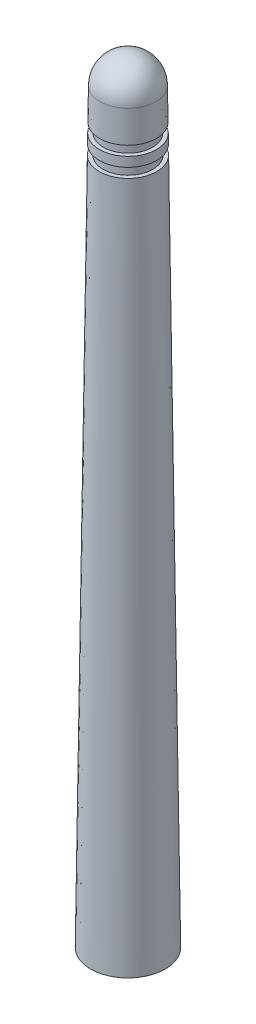
ISO-10303-21;
HEADER;
FILE_DESCRIPTION(('STEP AP214'),'2;1');
FILE_NAME('part.step','',(''),(''),'','','');
FILE_SCHEMA(('AUTOMOTIVE_DESIGN { 1 0 10303 214 1 1 1 1 }'));
ENDSEC;
DATA;
#1=APPLICATION_CONTEXT('core data for automotive mechanical design processes');
#2=APPLICATION_PROTOCOL_DEFINITION('international standard','automotive_design',2000,#1);
#3=PRODUCT_CONTEXT('',#1,'mechanical');
#4=PRODUCT('Part','Part','',(#3));
#5=PRODUCT_RELATED_PRODUCT_CATEGORY('part','',(#4));
#6=PRODUCT_DEFINITION_FORMATION('','',#4);
#7=PRODUCT_DEFINITION_CONTEXT('part definition',#1,'design');
#8=PRODUCT_DEFINITION('design','',#6,#7);
#9=PRODUCT_DEFINITION_SHAPE('','',#8);
#10=(LENGTH_UNIT() NAMED_UNIT(*) SI_UNIT(.MILLI.,.METRE.));
#11=(NAMED_UNIT(*) PLANE_ANGLE_UNIT() SI_UNIT($,.RADIAN.));
#12=(NAMED_UNIT(*) SI_UNIT($,.STERADIAN.) SOLID_ANGLE_UNIT());
#13=UNCERTAINTY_MEASURE_WITH_UNIT(LENGTH_MEASURE(1.E-05),#10,'distance_accuracy_value','');
#14=(GEOMETRIC_REPRESENTATION_CONTEXT(3) GLOBAL_UNCERTAINTY_ASSIGNED_CONTEXT((#13)) GLOBAL_UNIT_ASSIGNED_CONTEXT((#10,
#11,#12)) REPRESENTATION_CONTEXT('',''));
#15=CARTESIAN_POINT('',(0.,0.,0.));
#16=DIRECTION('',(0.,0.,1.));
#17=DIRECTION('',(1.,0.,0.));
#18=AXIS2_PLACEMENT_3D('',#15,#16,#17);
#19=CARTESIAN_POINT('',(0.,0.,0.));
#20=DIRECTION('',(0.,-1.,0.));
#21=DIRECTION('',(1.,0.,0.));
#22=AXIS2_PLACEMENT_3D('',#19,#20,#21);
#23=PLANE('',#22);
#24=CARTESIAN_POINT('',(0.,0.,0.));
#25=DIRECTION('',(0.,1.,0.));
#26=DIRECTION('',(-1.,0.,0.));
#27=AXIS2_PLACEMENT_3D('',#24,#25,#26);
#28=CIRCLE('',#27,5.);
#29=CARTESIAN_POINT('',(-5.,0.,0.));
#30=VERTEX_POINT('',#29);
#31=EDGE_CURVE('E10',#30,#30,#28,.T.);
#32=ORIENTED_EDGE('',*,*,#31,.F.);
#33=EDGE_LOOP('',(#32));
#34=FACE_BOUND('',#33,.T.);
#35=ADVANCED_FACE('F31',(#34),#23,.T.);
#36=CARTESIAN_POINT('',(0.,91.9383059519922,0.));
#37=DIRECTION('',(0.,-1.,0.));
#38=DIRECTION('',(1.,0.,0.));
#39=AXIS2_PLACEMENT_3D('',#36,#37,#38);
#40=CONICAL_SURFACE('',#39,3.85077117560009,0.0124993490193617);
#41=ORIENTED_EDGE('',*,*,#31,.T.);
#42=EDGE_LOOP('',(#41));
#43=FACE_BOUND('',#42,.T.);
#44=CARTESIAN_POINT('',(0.,91.9383059519922,0.));
#45=DIRECTION('',(0.,1.,0.));
#46=DIRECTION('',(-1.,0.,0.));
#47=AXIS2_PLACEMENT_3D('',#44,#45,#46);
#48=CIRCLE('',#47,3.85077117560009);
#49=CARTESIAN_POINT('',(-3.8507711756001,91.9383059519922,0.));
#50=VERTEX_POINT('',#49);
#51=EDGE_CURVE('E37',#50,#50,#48,.T.);
#52=ORIENTED_EDGE('',*,*,#51,.F.);
#53=EDGE_LOOP('',(#52));
#54=FACE_BOUND('',#53,.T.);
#55=ADVANCED_FACE('F85',(#43,#54),#40,.T.);
#56=CARTESIAN_POINT('',(-3.33488870350915,91.9383059519922,0.));
#57=DIRECTION('',(0.,1.,0.));
#58=DIRECTION('',(-1.,0.,0.));
#59=AXIS2_PLACEMENT_3D('',#56,#57,#58);
#60=PLANE('',#59);
#61=ORIENTED_EDGE('',*,*,#51,.T.);
#62=EDGE_LOOP('',(#61));
#63=FACE_BOUND('',#62,.T.);
#64=CARTESIAN_POINT('',(0.,91.9383059519922,0.));
#65=DIRECTION('',(0.,1.,0.));
#66=DIRECTION('',(-1.,0.,0.));
#67=AXIS2_PLACEMENT_3D('',#64,#65,#66);
#68=CIRCLE('',#67,3.33488870350915);
#69=CARTESIAN_POINT('',(-3.33488870350915,91.9383059519922,0.));
#70=VERTEX_POINT('',#69);
#71=EDGE_CURVE('E41',#70,#70,#68,.T.);
#72=ORIENTED_EDGE('',*,*,#71,.F.);
#73=EDGE_LOOP('',(#72));
#74=FACE_BOUND('',#73,.T.);
#75=ADVANCED_FACE('F90',(#63,#74),#60,.T.);
#76=CARTESIAN_POINT('',(0.,100.,0.));
#77=DIRECTION('',(0.,1.,0.));
#78=DIRECTION('',(-1.,0.,0.));
#79=AXIS2_PLACEMENT_3D('',#76,#77,#78);
#80=CYLINDRICAL_SURFACE('',#79,3.33488870350915);
#81=ORIENTED_EDGE('',*,*,#71,.T.);
#82=EDGE_LOOP('',(#81));
#83=FACE_BOUND('',#82,.T.);
#84=CARTESIAN_POINT('',(0.,93.208903719268,0.));
#85=DIRECTION('',(0.,1.,0.));
#86=DIRECTION('',(-1.,0.,0.));
#87=AXIS2_PLACEMENT_3D('',#84,#85,#86);
#88=CIRCLE('',#87,3.33488870350915);
#89=CARTESIAN_POINT('',(-3.33488870350915,93.208903719268,0.));
#90=VERTEX_POINT('',#89);
#91=EDGE_CURVE('E45',#90,#90,#88,.T.);
#92=ORIENTED_EDGE('',*,*,#91,.F.);
#93=EDGE_LOOP('',(#92));
#94=FACE_BOUND('',#93,.T.);
#95=ADVANCED_FACE('F94',(#83,#94),#80,.T.);
#96=CARTESIAN_POINT('',(-3.83488870350915,93.208903719268,0.));
#97=DIRECTION('',(0.,-1.,0.));
#98=DIRECTION('',(1.,0.,0.));
#99=AXIS2_PLACEMENT_3D('',#96,#97,#98);
#100=PLANE('',#99);
#101=ORIENTED_EDGE('',*,*,#91,.T.);
#102=EDGE_LOOP('',(#101));
#103=FACE_BOUND('',#102,.T.);
#104=CARTESIAN_POINT('',(0.,93.208903719268,0.));
#105=DIRECTION('',(0.,1.,0.));
#106=DIRECTION('',(-1.,0.,0.));
#107=AXIS2_PLACEMENT_3D('',#104,#105,#106);
#108=CIRCLE('',#107,3.83488870350915);
#109=CARTESIAN_POINT('',(-3.83488870350915,93.208903719268,0.));
#110=VERTEX_POINT('',#109);
#111=EDGE_CURVE('E50',#110,#110,#108,.T.);
#112=ORIENTED_EDGE('',*,*,#111,.F.);
#113=EDGE_LOOP('',(#112));
#114=FACE_BOUND('',#113,.T.);
#115=ADVANCED_FACE('F100',(#103,#114),#100,.T.);
#116=CARTESIAN_POINT('',(0.,94.4794022327243,0.));
#117=DIRECTION('',(0.,-1.,0.));
#118=DIRECTION('',(1.,0.,0.));
#119=AXIS2_PLACEMENT_3D('',#116,#117,#118);
#120=CONICAL_SURFACE('',#119,3.81900747209094,0.0124993490193615);
#121=ORIENTED_EDGE('',*,*,#111,.T.);
#122=EDGE_LOOP('',(#121));
#123=FACE_BOUND('',#122,.T.);
#124=CARTESIAN_POINT('',(0.,94.4794022327243,0.));
#125=DIRECTION('',(0.,1.,0.));
#126=DIRECTION('',(-1.,0.,0.));
#127=AXIS2_PLACEMENT_3D('',#124,#125,#126);
#128=CIRCLE('',#127,3.81900747209094);
#129=CARTESIAN_POINT('',(-3.81900747209095,94.4794022327243,0.));
#130=VERTEX_POINT('',#129);
#131=EDGE_CURVE('E53',#130,#130,#128,.T.);
#132=ORIENTED_EDGE('',*,*,#131,.F.);
#133=EDGE_LOOP('',(#132));
#134=FACE_BOUND('',#133,.T.);
#135=ADVANCED_FACE('F104',(#123,#134),#120,.T.);
#136=CARTESIAN_POINT('',(-3.303125,94.4794022327243,0.));
#137=DIRECTION('',(0.,1.,0.));
#138=DIRECTION('',(-1.,0.,0.));
#139=AXIS2_PLACEMENT_3D('',#136,#137,#138);
#140=PLANE('',#139);
#141=ORIENTED_EDGE('',*,*,#131,.T.);
#142=EDGE_LOOP('',(#141));
#143=FACE_BOUND('',#142,.T.);
#144=CARTESIAN_POINT('',(0.,94.4794022327243,0.));
#145=DIRECTION('',(0.,1.,0.));
#146=DIRECTION('',(-1.,0.,0.));
#147=AXIS2_PLACEMENT_3D('',#144,#145,#146);
#148=CIRCLE('',#147,3.303125);
#149=CARTESIAN_POINT('',(-3.303125,94.4794022327243,0.));
#150=VERTEX_POINT('',#149);
#151=EDGE_CURVE('E56',#150,#150,#148,.T.);
#152=ORIENTED_EDGE('',*,*,#151,.F.);
#153=EDGE_LOOP('',(#152));
#154=FACE_BOUND('',#153,.T.);
#155=ADVANCED_FACE('F108',(#143,#154),#140,.T.);
#156=CARTESIAN_POINT('',(0.,100.,0.));
#157=DIRECTION('',(0.,1.,0.));
#158=DIRECTION('',(-1.,0.,0.));
#159=AXIS2_PLACEMENT_3D('',#156,#157,#158);
#160=CYLINDRICAL_SURFACE('',#159,3.303125);
#161=ORIENTED_EDGE('',*,*,#151,.T.);
#162=EDGE_LOOP('',(#161));
#163=FACE_BOUND('',#162,.T.);
#164=CARTESIAN_POINT('',(0.,95.75,0.));
#165=DIRECTION('',(0.,1.,0.));
#166=DIRECTION('',(-1.,0.,0.));
#167=AXIS2_PLACEMENT_3D('',#164,#165,#166);
#168=CIRCLE('',#167,3.303125);
#169=CARTESIAN_POINT('',(-3.303125,95.75,0.));
#170=VERTEX_POINT('',#169);
#171=EDGE_CURVE('E59',#170,#170,#168,.T.);
#172=ORIENTED_EDGE('',*,*,#171,.F.);
#173=EDGE_LOOP('',(#172));
#174=FACE_BOUND('',#173,.T.);
#175=ADVANCED_FACE('F81',(#163,#174),#160,.T.);
#176=CARTESIAN_POINT('',(-3.803125,95.75,0.));
#177=DIRECTION('',(0.,-1.,0.));
#178=DIRECTION('',(1.,0.,0.));
#179=AXIS2_PLACEMENT_3D('',#176,#177,#178);
#180=PLANE('',#179);
#181=ORIENTED_EDGE('',*,*,#171,.T.);
#182=EDGE_LOOP('',(#181));
#183=FACE_BOUND('',#182,.T.);
#184=CARTESIAN_POINT('',(0.,95.75,0.));
#185=DIRECTION('',(0.,1.,0.));
#186=DIRECTION('',(-1.,0.,0.));
#187=AXIS2_PLACEMENT_3D('',#184,#185,#186);
#188=CIRCLE('',#187,3.803125);
#189=CARTESIAN_POINT('',(-3.803125,95.75,0.));
#190=VERTEX_POINT('',#189);
#191=EDGE_CURVE('E62',#190,#190,#188,.T.);
#192=ORIENTED_EDGE('',*,*,#191,.F.);
#193=EDGE_LOOP('',(#192));
#194=FACE_BOUND('',#193,.T.);
#195=ADVANCED_FACE('F73',(#183,#194),#180,.T.);
#196=CARTESIAN_POINT('',(0.,100.,0.));
#197=DIRECTION('',(0.,-1.,0.));
#198=DIRECTION('',(1.,0.,0.));
#199=AXIS2_PLACEMENT_3D('',#196,#197,#198);
#200=CONICAL_SURFACE('',#199,3.75,0.0124993490193611);
#201=ORIENTED_EDGE('',*,*,#191,.T.);
#202=EDGE_LOOP('',(#201));
#203=FACE_BOUND('',#202,.T.);
#204=CARTESIAN_POINT('',(0.,100.,0.));
#205=DIRECTION('',(0.,1.,0.));
#206=DIRECTION('',(-1.,0.,0.));
#207=AXIS2_PLACEMENT_3D('',#204,#205,#206);
#208=CIRCLE('',#207,3.75);
#209=CARTESIAN_POINT('',(-3.75,100.,0.));
#210=VERTEX_POINT('',#209);
#211=EDGE_CURVE('E65',#210,#210,#208,.T.);
#212=ORIENTED_EDGE('',*,*,#211,.F.);
#213=EDGE_LOOP('',(#212));
#214=FACE_BOUND('',#213,.T.);
#215=ADVANCED_FACE('F71',(#203,#214),#200,.T.);
#216=CARTESIAN_POINT('',(0.,100.,0.));
#217=DIRECTION('',(0.,1.,0.));
#218=DIRECTION('',(1.,0.,0.));
#219=AXIS2_PLACEMENT_3D('',#216,#217,#218);
#220=SPHERICAL_SURFACE('',#219,3.75);
#221=ORIENTED_EDGE('',*,*,#211,.T.);
#222=EDGE_LOOP('',(#221));
#223=FACE_BOUND('',#222,.T.);
#224=ADVANCED_FACE('F69',(#223),#220,.T.);
#225=CLOSED_SHELL('',(#35,#55,#75,#95,#115,#135,#155,#175,#195,#215,#224));
#226=MANIFOLD_SOLID_BREP('B2',#225);
#227=ADVANCED_BREP_SHAPE_REPRESENTATION('',(#18,#226),#14);
#228=SHAPE_DEFINITION_REPRESENTATION(#9,#227);
ENDSEC;
END-ISO-10303-21;
